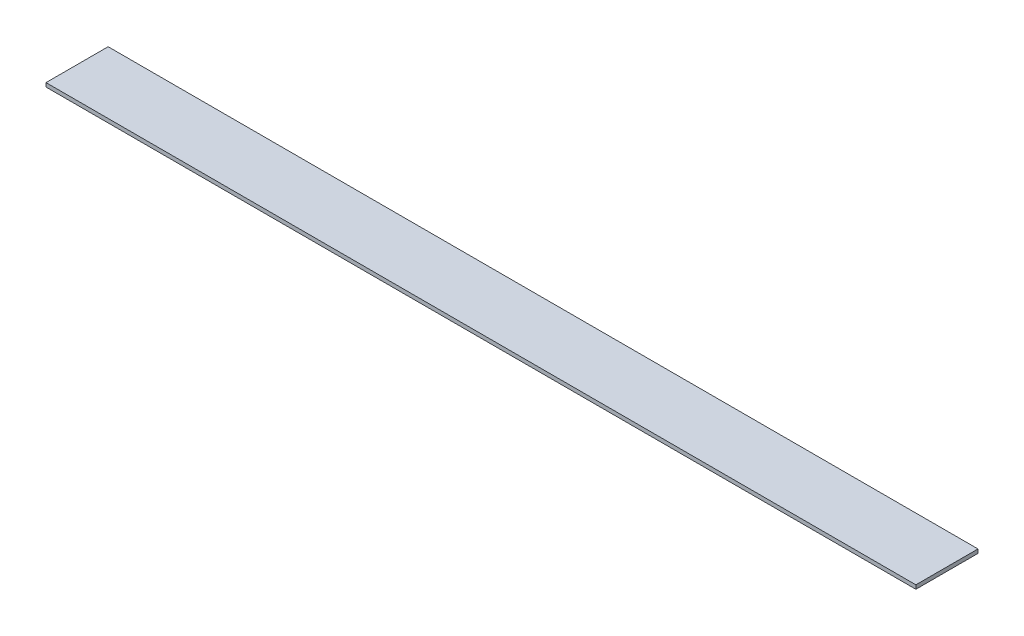
ISO-10303-21;
HEADER;
FILE_DESCRIPTION(('STEP AP214'),'2;1');
FILE_NAME('part.step','',(''),(''),'','','');
FILE_SCHEMA(('AUTOMOTIVE_DESIGN { 1 0 10303 214 1 1 1 1 }'));
ENDSEC;
DATA;
#1=APPLICATION_CONTEXT('core data for automotive mechanical design processes');
#2=APPLICATION_PROTOCOL_DEFINITION('international standard','automotive_design',2000,#1);
#3=PRODUCT_CONTEXT('',#1,'mechanical');
#4=PRODUCT('Part','Part','',(#3));
#5=PRODUCT_RELATED_PRODUCT_CATEGORY('part','',(#4));
#6=PRODUCT_DEFINITION_FORMATION('','',#4);
#7=PRODUCT_DEFINITION_CONTEXT('part definition',#1,'design');
#8=PRODUCT_DEFINITION('design','',#6,#7);
#9=PRODUCT_DEFINITION_SHAPE('','',#8);
#10=(LENGTH_UNIT() NAMED_UNIT(*) SI_UNIT(.MILLI.,.METRE.));
#11=(NAMED_UNIT(*) PLANE_ANGLE_UNIT() SI_UNIT($,.RADIAN.));
#12=(NAMED_UNIT(*) SI_UNIT($,.STERADIAN.) SOLID_ANGLE_UNIT());
#13=UNCERTAINTY_MEASURE_WITH_UNIT(LENGTH_MEASURE(1.E-05),#10,'distance_accuracy_value','');
#14=(GEOMETRIC_REPRESENTATION_CONTEXT(3) GLOBAL_UNCERTAINTY_ASSIGNED_CONTEXT((#13)) GLOBAL_UNIT_ASSIGNED_CONTEXT((#10,
#11,#12)) REPRESENTATION_CONTEXT('',''));
#15=CARTESIAN_POINT('',(0.,0.,0.));
#16=DIRECTION('',(0.,0.,1.));
#17=DIRECTION('',(1.,0.,0.));
#18=AXIS2_PLACEMENT_3D('',#15,#16,#17);
#19=CARTESIAN_POINT('',(0.,1.5875,0.));
#20=DIRECTION('',(1.,0.,0.));
#21=DIRECTION('',(0.,0.,-1.));
#22=AXIS2_PLACEMENT_3D('',#19,#20,#21);
#23=PLANE('',#22);
#24=DIRECTION('',(0.,0.,1.));
#25=VECTOR('',#24,1.);
#26=CARTESIAN_POINT('',(0.,0.,0.));
#27=LINE('',#26,#25);
#28=CARTESIAN_POINT('',(0.,0.,-25.4));
#29=VERTEX_POINT('',#28);
#30=CARTESIAN_POINT('',(0.,0.,0.));
#31=VERTEX_POINT('',#30);
#32=EDGE_CURVE('E98',#29,#31,#27,.T.);
#33=ORIENTED_EDGE('',*,*,#32,.T.);
#34=DIRECTION('',(0.,-1.,0.));
#35=VECTOR('',#34,1.);
#36=CARTESIAN_POINT('',(0.,1.5875,0.));
#37=LINE('',#36,#35);
#38=CARTESIAN_POINT('',(0.,1.5875,0.));
#39=VERTEX_POINT('',#38);
#40=EDGE_CURVE('E11',#39,#31,#37,.T.);
#41=ORIENTED_EDGE('',*,*,#40,.F.);
#42=DIRECTION('',(0.,0.,1.));
#43=VECTOR('',#42,1.);
#44=CARTESIAN_POINT('',(0.,1.5875,0.));
#45=LINE('',#44,#43);
#46=CARTESIAN_POINT('',(0.,1.5875,-25.4));
#47=VERTEX_POINT('',#46);
#48=EDGE_CURVE('E86',#47,#39,#45,.T.);
#49=ORIENTED_EDGE('',*,*,#48,.F.);
#50=DIRECTION('',(0.,-1.,0.));
#51=VECTOR('',#50,1.);
#52=CARTESIAN_POINT('',(0.,1.5875,-25.4));
#53=LINE('',#52,#51);
#54=EDGE_CURVE('E94',#47,#29,#53,.T.);
#55=ORIENTED_EDGE('',*,*,#54,.T.);
#56=EDGE_LOOP('',(#33,#41,#49,#55));
#57=FACE_BOUND('',#56,.T.);
#58=ADVANCED_FACE('F35',(#57),#23,.F.);
#59=CARTESIAN_POINT('',(0.,1.5875,0.));
#60=DIRECTION('',(0.,0.,-1.));
#61=DIRECTION('',(-1.,0.,0.));
#62=AXIS2_PLACEMENT_3D('',#59,#60,#61);
#63=PLANE('',#62);
#64=DIRECTION('',(1.,0.,0.));
#65=VECTOR('',#64,1.);
#66=CARTESIAN_POINT('',(0.,0.,0.));
#67=LINE('',#66,#65);
#68=CARTESIAN_POINT('',(355.6,0.,0.));
#69=VERTEX_POINT('',#68);
#70=EDGE_CURVE('E90',#31,#69,#67,.T.);
#71=ORIENTED_EDGE('',*,*,#70,.T.);
#72=DIRECTION('',(0.,-1.,0.));
#73=VECTOR('',#72,1.);
#74=CARTESIAN_POINT('',(355.6,1.5875,0.));
#75=LINE('',#74,#73);
#76=CARTESIAN_POINT('',(355.6,1.5875,0.));
#77=VERTEX_POINT('',#76);
#78=EDGE_CURVE('E43',#77,#69,#75,.T.);
#79=ORIENTED_EDGE('',*,*,#78,.F.);
#80=DIRECTION('',(1.,0.,0.));
#81=VECTOR('',#80,1.);
#82=CARTESIAN_POINT('',(0.,1.5875,0.));
#83=LINE('',#82,#81);
#84=EDGE_CURVE('E81',#39,#77,#83,.T.);
#85=ORIENTED_EDGE('',*,*,#84,.F.);
#86=ORIENTED_EDGE('',*,*,#40,.T.);
#87=EDGE_LOOP('',(#71,#79,#85,#86));
#88=FACE_BOUND('',#87,.T.);
#89=ADVANCED_FACE('F89',(#88),#63,.F.);
#90=CARTESIAN_POINT('',(355.6,1.5875,0.));
#91=DIRECTION('',(-1.,0.,0.));
#92=DIRECTION('',(0.,0.,1.));
#93=AXIS2_PLACEMENT_3D('',#90,#91,#92);
#94=PLANE('',#93);
#95=DIRECTION('',(0.,0.,-1.));
#96=VECTOR('',#95,1.);
#97=CARTESIAN_POINT('',(355.6,0.,0.));
#98=LINE('',#97,#96);
#99=CARTESIAN_POINT('',(355.6,0.,-25.4));
#100=VERTEX_POINT('',#99);
#101=EDGE_CURVE('E68',#69,#100,#98,.T.);
#102=ORIENTED_EDGE('',*,*,#101,.T.);
#103=DIRECTION('',(0.,-1.,0.));
#104=VECTOR('',#103,1.);
#105=CARTESIAN_POINT('',(355.6,1.5875,-25.4));
#106=LINE('',#105,#104);
#107=CARTESIAN_POINT('',(355.6,1.5875,-25.4));
#108=VERTEX_POINT('',#107);
#109=EDGE_CURVE('E91',#108,#100,#106,.T.);
#110=ORIENTED_EDGE('',*,*,#109,.F.);
#111=DIRECTION('',(0.,0.,-1.));
#112=VECTOR('',#111,1.);
#113=CARTESIAN_POINT('',(355.6,1.5875,0.));
#114=LINE('',#113,#112);
#115=EDGE_CURVE('E84',#77,#108,#114,.T.);
#116=ORIENTED_EDGE('',*,*,#115,.F.);
#117=ORIENTED_EDGE('',*,*,#78,.T.);
#118=EDGE_LOOP('',(#102,#110,#116,#117));
#119=FACE_BOUND('',#118,.T.);
#120=ADVANCED_FACE('F92',(#119),#94,.F.);
#121=CARTESIAN_POINT('',(0.,1.5875,-25.4));
#122=DIRECTION('',(0.,0.,1.));
#123=DIRECTION('',(1.,0.,0.));
#124=AXIS2_PLACEMENT_3D('',#121,#122,#123);
#125=PLANE('',#124);
#126=DIRECTION('',(-1.,0.,0.));
#127=VECTOR('',#126,1.);
#128=CARTESIAN_POINT('',(0.,0.,-25.4));
#129=LINE('',#128,#127);
#130=EDGE_CURVE('E74',#100,#29,#129,.T.);
#131=ORIENTED_EDGE('',*,*,#130,.T.);
#132=ORIENTED_EDGE('',*,*,#54,.F.);
#133=DIRECTION('',(-1.,0.,0.));
#134=VECTOR('',#133,1.);
#135=CARTESIAN_POINT('',(0.,1.5875,-25.4));
#136=LINE('',#135,#134);
#137=EDGE_CURVE('E51',#108,#47,#136,.T.);
#138=ORIENTED_EDGE('',*,*,#137,.F.);
#139=ORIENTED_EDGE('',*,*,#109,.T.);
#140=EDGE_LOOP('',(#131,#132,#138,#139));
#141=FACE_BOUND('',#140,.T.);
#142=ADVANCED_FACE('F105',(#141),#125,.F.);
#143=CARTESIAN_POINT('',(0.,1.5875,0.));
#144=DIRECTION('',(0.,-1.,0.));
#145=DIRECTION('',(0.,0.,-1.));
#146=AXIS2_PLACEMENT_3D('',#143,#144,#145);
#147=PLANE('',#146);
#148=ORIENTED_EDGE('',*,*,#48,.T.);
#149=ORIENTED_EDGE('',*,*,#84,.T.);
#150=ORIENTED_EDGE('',*,*,#115,.T.);
#151=ORIENTED_EDGE('',*,*,#137,.T.);
#152=EDGE_LOOP('',(#148,#149,#150,#151));
#153=FACE_BOUND('',#152,.T.);
#154=ADVANCED_FACE('F82',(#153),#147,.F.);
#155=CARTESIAN_POINT('',(0.,0.,0.));
#156=DIRECTION('',(0.,-1.,0.));
#157=DIRECTION('',(0.,0.,-1.));
#158=AXIS2_PLACEMENT_3D('',#155,#156,#157);
#159=PLANE('',#158);
#160=ORIENTED_EDGE('',*,*,#32,.F.);
#161=ORIENTED_EDGE('',*,*,#130,.F.);
#162=ORIENTED_EDGE('',*,*,#101,.F.);
#163=ORIENTED_EDGE('',*,*,#70,.F.);
#164=EDGE_LOOP('',(#160,#161,#162,#163));
#165=FACE_BOUND('',#164,.T.);
#166=ADVANCED_FACE('F108',(#165),#159,.T.);
#167=CLOSED_SHELL('',(#58,#89,#120,#142,#154,#166));
#168=MANIFOLD_SOLID_BREP('B2',#167);
#169=ADVANCED_BREP_SHAPE_REPRESENTATION('',(#18,#168),#14);
#170=SHAPE_DEFINITION_REPRESENTATION(#9,#169);
ENDSEC;
END-ISO-10303-21;
